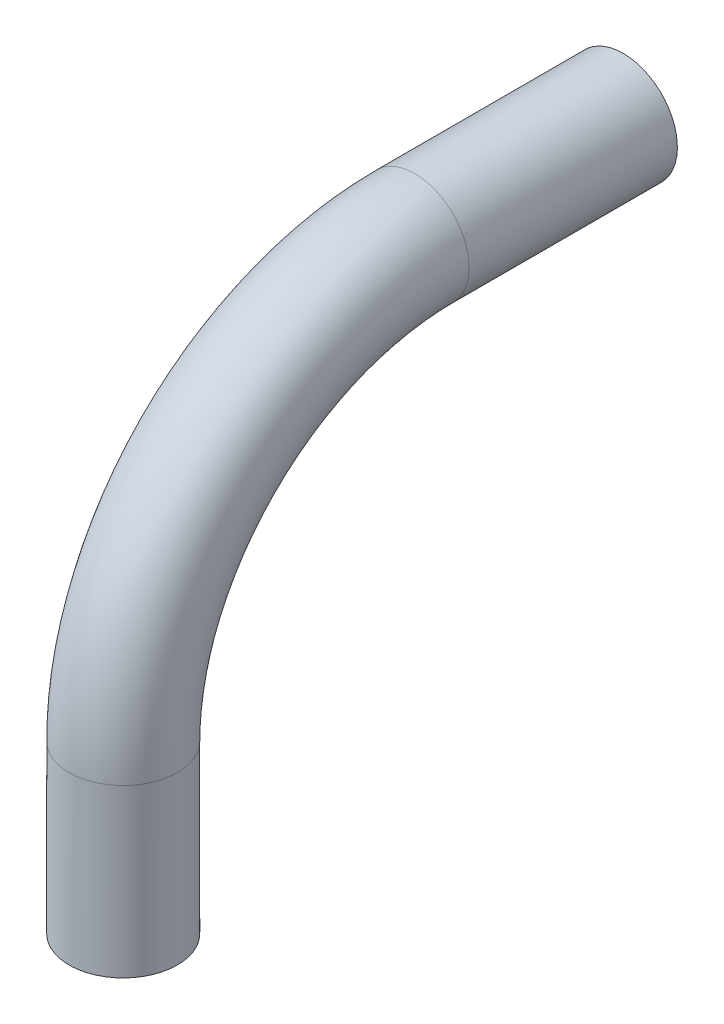
ISO-10303-21;
HEADER;
FILE_DESCRIPTION(('STEP AP214'),'2;1');
FILE_NAME('part.step','',(''),(''),'','','');
FILE_SCHEMA(('AUTOMOTIVE_DESIGN { 1 0 10303 214 1 1 1 1 }'));
ENDSEC;
DATA;
#1=APPLICATION_CONTEXT('core data for automotive mechanical design processes');
#2=APPLICATION_PROTOCOL_DEFINITION('international standard','automotive_design',2000,#1);
#3=PRODUCT_CONTEXT('',#1,'mechanical');
#4=PRODUCT('Part','Part','',(#3));
#5=PRODUCT_RELATED_PRODUCT_CATEGORY('part','',(#4));
#6=PRODUCT_DEFINITION_FORMATION('','',#4);
#7=PRODUCT_DEFINITION_CONTEXT('part definition',#1,'design');
#8=PRODUCT_DEFINITION('design','',#6,#7);
#9=PRODUCT_DEFINITION_SHAPE('','',#8);
#10=(LENGTH_UNIT() NAMED_UNIT(*) SI_UNIT(.MILLI.,.METRE.));
#11=(NAMED_UNIT(*) PLANE_ANGLE_UNIT() SI_UNIT($,.RADIAN.));
#12=(NAMED_UNIT(*) SI_UNIT($,.STERADIAN.) SOLID_ANGLE_UNIT());
#13=UNCERTAINTY_MEASURE_WITH_UNIT(LENGTH_MEASURE(1.E-05),#10,'distance_accuracy_value','');
#14=(GEOMETRIC_REPRESENTATION_CONTEXT(3) GLOBAL_UNCERTAINTY_ASSIGNED_CONTEXT((#13)) GLOBAL_UNIT_ASSIGNED_CONTEXT((#10,
#11,#12)) REPRESENTATION_CONTEXT('',''));
#15=CARTESIAN_POINT('',(0.,0.,0.));
#16=DIRECTION('',(0.,0.,1.));
#17=DIRECTION('',(1.,0.,0.));
#18=AXIS2_PLACEMENT_3D('',#15,#16,#17);
#19=CARTESIAN_POINT('',(0.,0.,0.));
#20=DIRECTION('',(0.,0.,1.));
#21=DIRECTION('',(1.,0.,0.));
#22=AXIS2_PLACEMENT_3D('',#19,#20,#21);
#23=PLANE('',#22);
#24=CARTESIAN_POINT('',(0.,0.,0.));
#25=DIRECTION('',(0.,0.,-1.));
#26=DIRECTION('',(0.,1.,0.));
#27=AXIS2_PLACEMENT_3D('',#24,#25,#26);
#28=CIRCLE('',#27,0.13);
#29=CARTESIAN_POINT('',(0.,0.13,0.));
#30=VERTEX_POINT('',#29);
#31=EDGE_CURVE('E18',#30,#30,#28,.F.);
#32=ORIENTED_EDGE('',*,*,#31,.F.);
#33=EDGE_LOOP('',(#32));
#34=FACE_BOUND('',#33,.T.);
#35=ADVANCED_FACE('F15',(#34),#23,.F.);
#36=CARTESIAN_POINT('',(0.,-1.1,1.2));
#37=DIRECTION('',(0.,-1.,0.));
#38=DIRECTION('',(0.,0.,-1.));
#39=AXIS2_PLACEMENT_3D('',#36,#37,#38);
#40=PLANE('',#39);
#41=CARTESIAN_POINT('',(0.,-1.1,1.2));
#42=DIRECTION('',(0.,-1.,0.));
#43=DIRECTION('',(0.,0.,-1.));
#44=AXIS2_PLACEMENT_3D('',#41,#42,#43);
#45=CIRCLE('',#44,0.13);
#46=CARTESIAN_POINT('',(0.,-1.1,1.07));
#47=VERTEX_POINT('',#46);
#48=EDGE_CURVE('E27',#47,#47,#45,.F.);
#49=ORIENTED_EDGE('',*,*,#48,.F.);
#50=EDGE_LOOP('',(#49));
#51=FACE_BOUND('',#50,.T.);
#52=ADVANCED_FACE('F40',(#51),#40,.T.);
#53=CARTESIAN_POINT('',(0.,0.,0.5));
#54=DIRECTION('',(0.,0.,-1.));
#55=DIRECTION('',(0.,1.,0.));
#56=AXIS2_PLACEMENT_3D('',#53,#54,#55);
#57=CYLINDRICAL_SURFACE('',#56,0.13);
#58=CARTESIAN_POINT('',(0.,0.,0.5));
#59=DIRECTION('',(0.,0.,1.));
#60=DIRECTION('',(0.,1.,0.));
#61=AXIS2_PLACEMENT_3D('',#58,#59,#60);
#62=CIRCLE('',#61,0.13);
#63=CARTESIAN_POINT('',(0.,0.13,0.5));
#64=VERTEX_POINT('',#63);
#65=EDGE_CURVE('E22',#64,#64,#62,.T.);
#66=ORIENTED_EDGE('',*,*,#65,.F.);
#67=EDGE_LOOP('',(#66));
#68=FACE_BOUND('',#67,.T.);
#69=ORIENTED_EDGE('',*,*,#31,.T.);
#70=EDGE_LOOP('',(#69));
#71=FACE_BOUND('',#70,.T.);
#72=ADVANCED_FACE('F37',(#68,#71),#57,.T.);
#73=CARTESIAN_POINT('',(0.,-0.7,1.2));
#74=DIRECTION('',(0.,-1.,0.));
#75=DIRECTION('',(0.,0.,-1.));
#76=AXIS2_PLACEMENT_3D('',#73,#74,#75);
#77=CYLINDRICAL_SURFACE('',#76,0.13);
#78=CARTESIAN_POINT('',(0.,-0.7,1.2));
#79=DIRECTION('',(0.,-1.,0.));
#80=DIRECTION('',(0.,0.,1.));
#81=AXIS2_PLACEMENT_3D('',#78,#79,#80);
#82=CIRCLE('',#81,0.13);
#83=CARTESIAN_POINT('',(0.,-0.7,1.33));
#84=VERTEX_POINT('',#83);
#85=EDGE_CURVE('E10',#84,#84,#82,.F.);
#86=ORIENTED_EDGE('',*,*,#85,.F.);
#87=EDGE_LOOP('',(#86));
#88=FACE_BOUND('',#87,.T.);
#89=ORIENTED_EDGE('',*,*,#48,.T.);
#90=EDGE_LOOP('',(#89));
#91=FACE_BOUND('',#90,.T.);
#92=ADVANCED_FACE('F48',(#88,#91),#77,.T.);
#93=CARTESIAN_POINT('',(0.,-0.7,0.5));
#94=DIRECTION('',(1.,0.,0.));
#95=DIRECTION('',(0.,0.,-1.));
#96=AXIS2_PLACEMENT_3D('',#93,#94,#95);
#97=TOROIDAL_SURFACE('',#96,0.7,0.13);
#98=ORIENTED_EDGE('',*,*,#65,.T.);
#99=EDGE_LOOP('',(#98));
#100=FACE_BOUND('',#99,.T.);
#101=ORIENTED_EDGE('',*,*,#85,.T.);
#102=EDGE_LOOP('',(#101));
#103=FACE_BOUND('',#102,.T.);
#104=ADVANCED_FACE('F46',(#100,#103),#97,.T.);
#105=CLOSED_SHELL('',(#35,#52,#72,#92,#104));
#106=MANIFOLD_SOLID_BREP('B1',#105);
#107=ADVANCED_BREP_SHAPE_REPRESENTATION('',(#18,#106),#14);
#108=SHAPE_DEFINITION_REPRESENTATION(#9,#107);
ENDSEC;
END-ISO-10303-21;
